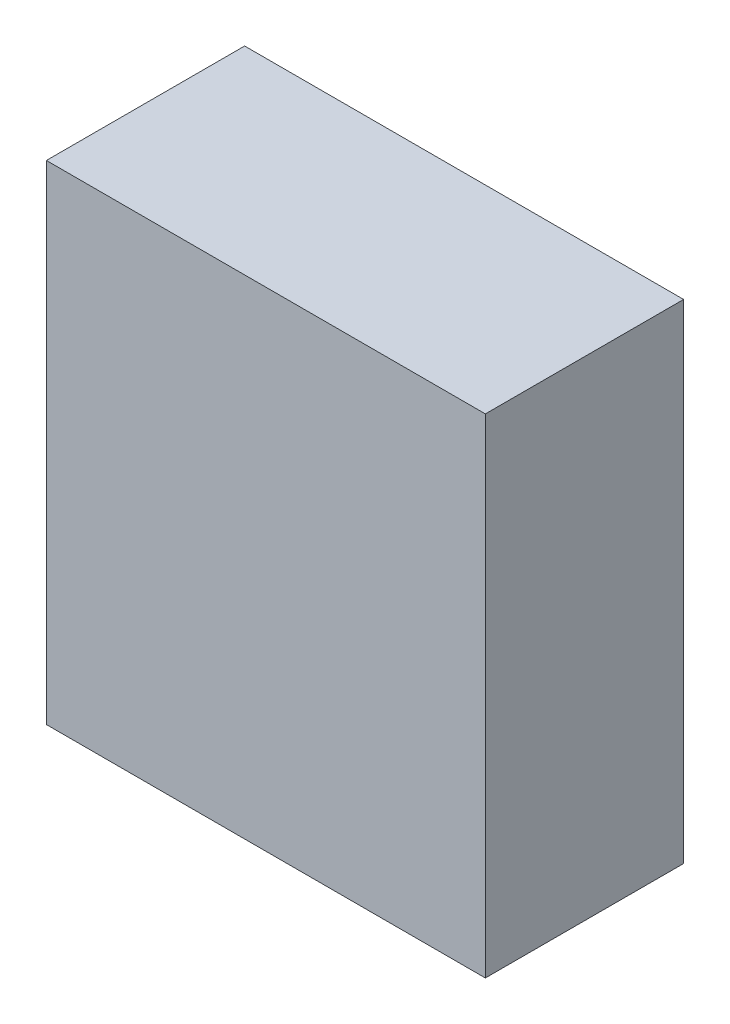
ISO-10303-21;
HEADER;
FILE_DESCRIPTION(('STEP AP214'),'2;1');
FILE_NAME('part.step','',(''),(''),'','','');
FILE_SCHEMA(('AUTOMOTIVE_DESIGN { 1 0 10303 214 1 1 1 1 }'));
ENDSEC;
DATA;
#1=APPLICATION_CONTEXT('core data for automotive mechanical design processes');
#2=APPLICATION_PROTOCOL_DEFINITION('international standard','automotive_design',2000,#1);
#3=PRODUCT_CONTEXT('',#1,'mechanical');
#4=PRODUCT('Part','Part','',(#3));
#5=PRODUCT_RELATED_PRODUCT_CATEGORY('part','',(#4));
#6=PRODUCT_DEFINITION_FORMATION('','',#4);
#7=PRODUCT_DEFINITION_CONTEXT('part definition',#1,'design');
#8=PRODUCT_DEFINITION('design','',#6,#7);
#9=PRODUCT_DEFINITION_SHAPE('','',#8);
#10=(LENGTH_UNIT() NAMED_UNIT(*) SI_UNIT(.MILLI.,.METRE.));
#11=(NAMED_UNIT(*) PLANE_ANGLE_UNIT() SI_UNIT($,.RADIAN.));
#12=(NAMED_UNIT(*) SI_UNIT($,.STERADIAN.) SOLID_ANGLE_UNIT());
#13=UNCERTAINTY_MEASURE_WITH_UNIT(LENGTH_MEASURE(1.E-05),#10,'distance_accuracy_value','');
#14=(GEOMETRIC_REPRESENTATION_CONTEXT(3) GLOBAL_UNCERTAINTY_ASSIGNED_CONTEXT((#13)) GLOBAL_UNIT_ASSIGNED_CONTEXT((#10,
#11,#12)) REPRESENTATION_CONTEXT('',''));
#15=CARTESIAN_POINT('',(0.,0.,0.));
#16=DIRECTION('',(0.,0.,1.));
#17=DIRECTION('',(1.,0.,0.));
#18=AXIS2_PLACEMENT_3D('',#15,#16,#17);
#19=CARTESIAN_POINT('',(1.54999944,1.72500036,1.39999974));
#20=DIRECTION('',(0.,0.,-1.));
#21=DIRECTION('',(-1.,0.,0.));
#22=AXIS2_PLACEMENT_3D('',#19,#20,#21);
#23=PLANE('',#22);
#24=DIRECTION('',(0.,1.,0.));
#25=VECTOR('',#24,1.);
#26=CARTESIAN_POINT('',(-1.54999944,1.72500036,1.39999974));
#27=LINE('',#26,#25);
#28=CARTESIAN_POINT('',(-1.54999944,1.72500036,1.39999974));
#29=VERTEX_POINT('',#28);
#30=CARTESIAN_POINT('',(-1.54999944,-1.72500036,1.39999974));
#31=VERTEX_POINT('',#30);
#32=EDGE_CURVE('E55',#29,#31,#27,.F.);
#33=ORIENTED_EDGE('',*,*,#32,.T.);
#34=DIRECTION('',(1.,0.,0.));
#35=VECTOR('',#34,1.);
#36=CARTESIAN_POINT('',(-1.54999944,-1.72500036,1.39999974));
#37=LINE('',#36,#35);
#38=CARTESIAN_POINT('',(1.54999944,-1.72500036,1.39999974));
#39=VERTEX_POINT('',#38);
#40=EDGE_CURVE('E57',#31,#39,#37,.T.);
#41=ORIENTED_EDGE('',*,*,#40,.T.);
#42=DIRECTION('',(0.,1.,0.));
#43=VECTOR('',#42,1.);
#44=CARTESIAN_POINT('',(1.54999944,-1.72500036,1.39999974));
#45=LINE('',#44,#43);
#46=CARTESIAN_POINT('',(1.54999944,1.72500036,1.39999974));
#47=VERTEX_POINT('',#46);
#48=EDGE_CURVE('E20',#39,#47,#45,.T.);
#49=ORIENTED_EDGE('',*,*,#48,.T.);
#50=DIRECTION('',(1.,0.,0.));
#51=VECTOR('',#50,1.);
#52=CARTESIAN_POINT('',(1.54999944,1.72500036,1.39999974));
#53=LINE('',#52,#51);
#54=EDGE_CURVE('E80',#47,#29,#53,.F.);
#55=ORIENTED_EDGE('',*,*,#54,.T.);
#56=EDGE_LOOP('',(#33,#41,#49,#55));
#57=FACE_BOUND('',#56,.T.);
#58=ADVANCED_FACE('F17',(#57),#23,.F.);
#59=CARTESIAN_POINT('',(1.54999944,-1.72500036,0.));
#60=DIRECTION('',(-1.,0.,0.));
#61=DIRECTION('',(0.,0.,1.));
#62=AXIS2_PLACEMENT_3D('',#59,#60,#61);
#63=PLANE('',#62);
#64=DIRECTION('',(0.,0.,-1.));
#65=VECTOR('',#64,1.);
#66=CARTESIAN_POINT('',(1.54999944,1.72500036,0.));
#67=LINE('',#66,#65);
#68=CARTESIAN_POINT('',(1.54999944,1.72500036,0.));
#69=VERTEX_POINT('',#68);
#70=EDGE_CURVE('E68',#69,#47,#67,.F.);
#71=ORIENTED_EDGE('',*,*,#70,.T.);
#72=ORIENTED_EDGE('',*,*,#48,.F.);
#73=DIRECTION('',(0.,0.,1.));
#74=VECTOR('',#73,1.);
#75=CARTESIAN_POINT('',(1.54999944,-1.72500036,0.));
#76=LINE('',#75,#74);
#77=CARTESIAN_POINT('',(1.54999944,-1.72500036,0.));
#78=VERTEX_POINT('',#77);
#79=EDGE_CURVE('E63',#39,#78,#76,.F.);
#80=ORIENTED_EDGE('',*,*,#79,.T.);
#81=DIRECTION('',(0.,1.,0.));
#82=VECTOR('',#81,1.);
#83=CARTESIAN_POINT('',(1.54999944,1.72500036,0.));
#84=LINE('',#83,#82);
#85=EDGE_CURVE('E83',#69,#78,#84,.F.);
#86=ORIENTED_EDGE('',*,*,#85,.F.);
#87=EDGE_LOOP('',(#71,#72,#80,#86));
#88=FACE_BOUND('',#87,.T.);
#89=ADVANCED_FACE('F65',(#88),#63,.F.);
#90=CARTESIAN_POINT('',(-1.54999944,-1.72500036,0.));
#91=DIRECTION('',(0.,1.,0.));
#92=DIRECTION('',(0.,0.,1.));
#93=AXIS2_PLACEMENT_3D('',#90,#91,#92);
#94=PLANE('',#93);
#95=ORIENTED_EDGE('',*,*,#79,.F.);
#96=ORIENTED_EDGE('',*,*,#40,.F.);
#97=DIRECTION('',(0.,0.,-1.));
#98=VECTOR('',#97,1.);
#99=CARTESIAN_POINT('',(-1.54999944,-1.72500036,0.));
#100=LINE('',#99,#98);
#101=CARTESIAN_POINT('',(-1.54999944,-1.72500036,0.));
#102=VERTEX_POINT('',#101);
#103=EDGE_CURVE('E75',#31,#102,#100,.T.);
#104=ORIENTED_EDGE('',*,*,#103,.T.);
#105=DIRECTION('',(-1.,0.,0.));
#106=VECTOR('',#105,1.);
#107=CARTESIAN_POINT('',(1.54999944,-1.72500036,0.));
#108=LINE('',#107,#106);
#109=EDGE_CURVE('E72',#78,#102,#108,.T.);
#110=ORIENTED_EDGE('',*,*,#109,.F.);
#111=EDGE_LOOP('',(#95,#96,#104,#110));
#112=FACE_BOUND('',#111,.T.);
#113=ADVANCED_FACE('F70',(#112),#94,.F.);
#114=CARTESIAN_POINT('',(-1.54999944,1.72500036,0.));
#115=DIRECTION('',(1.,0.,0.));
#116=DIRECTION('',(0.,0.,-1.));
#117=AXIS2_PLACEMENT_3D('',#114,#115,#116);
#118=PLANE('',#117);
#119=ORIENTED_EDGE('',*,*,#103,.F.);
#120=ORIENTED_EDGE('',*,*,#32,.F.);
#121=DIRECTION('',(0.,0.,-1.));
#122=VECTOR('',#121,1.);
#123=CARTESIAN_POINT('',(-1.54999944,1.72500036,0.));
#124=LINE('',#123,#122);
#125=CARTESIAN_POINT('',(-1.54999944,1.72500036,0.));
#126=VERTEX_POINT('',#125);
#127=EDGE_CURVE('E35',#29,#126,#124,.T.);
#128=ORIENTED_EDGE('',*,*,#127,.T.);
#129=DIRECTION('',(0.,1.,0.));
#130=VECTOR('',#129,1.);
#131=CARTESIAN_POINT('',(-1.54999944,1.72500036,0.));
#132=LINE('',#131,#130);
#133=EDGE_CURVE('E26',#102,#126,#132,.T.);
#134=ORIENTED_EDGE('',*,*,#133,.F.);
#135=EDGE_LOOP('',(#119,#120,#128,#134));
#136=FACE_BOUND('',#135,.T.);
#137=ADVANCED_FACE('F89',(#136),#118,.F.);
#138=CARTESIAN_POINT('',(1.54999944,1.72500036,0.));
#139=DIRECTION('',(0.,-1.,0.));
#140=DIRECTION('',(0.,0.,-1.));
#141=AXIS2_PLACEMENT_3D('',#138,#139,#140);
#142=PLANE('',#141);
#143=ORIENTED_EDGE('',*,*,#127,.F.);
#144=ORIENTED_EDGE('',*,*,#54,.F.);
#145=ORIENTED_EDGE('',*,*,#70,.F.);
#146=DIRECTION('',(-1.,0.,0.));
#147=VECTOR('',#146,1.);
#148=CARTESIAN_POINT('',(1.54999944,1.72500036,0.));
#149=LINE('',#148,#147);
#150=EDGE_CURVE('E11',#126,#69,#149,.F.);
#151=ORIENTED_EDGE('',*,*,#150,.F.);
#152=EDGE_LOOP('',(#143,#144,#145,#151));
#153=FACE_BOUND('',#152,.T.);
#154=ADVANCED_FACE('F91',(#153),#142,.F.);
#155=CARTESIAN_POINT('',(1.54999944,1.72500036,0.));
#156=DIRECTION('',(0.,0.,-1.));
#157=DIRECTION('',(-1.,0.,0.));
#158=AXIS2_PLACEMENT_3D('',#155,#156,#157);
#159=PLANE('',#158);
#160=ORIENTED_EDGE('',*,*,#133,.T.);
#161=ORIENTED_EDGE('',*,*,#150,.T.);
#162=ORIENTED_EDGE('',*,*,#85,.T.);
#163=ORIENTED_EDGE('',*,*,#109,.T.);
#164=EDGE_LOOP('',(#160,#161,#162,#163));
#165=FACE_BOUND('',#164,.T.);
#166=ADVANCED_FACE('F88',(#165),#159,.T.);
#167=CLOSED_SHELL('',(#58,#89,#113,#137,#154,#166));
#168=MANIFOLD_SOLID_BREP('B1',#167);
#169=ADVANCED_BREP_SHAPE_REPRESENTATION('',(#18,#168),#14);
#170=SHAPE_DEFINITION_REPRESENTATION(#9,#169);
ENDSEC;
END-ISO-10303-21;
